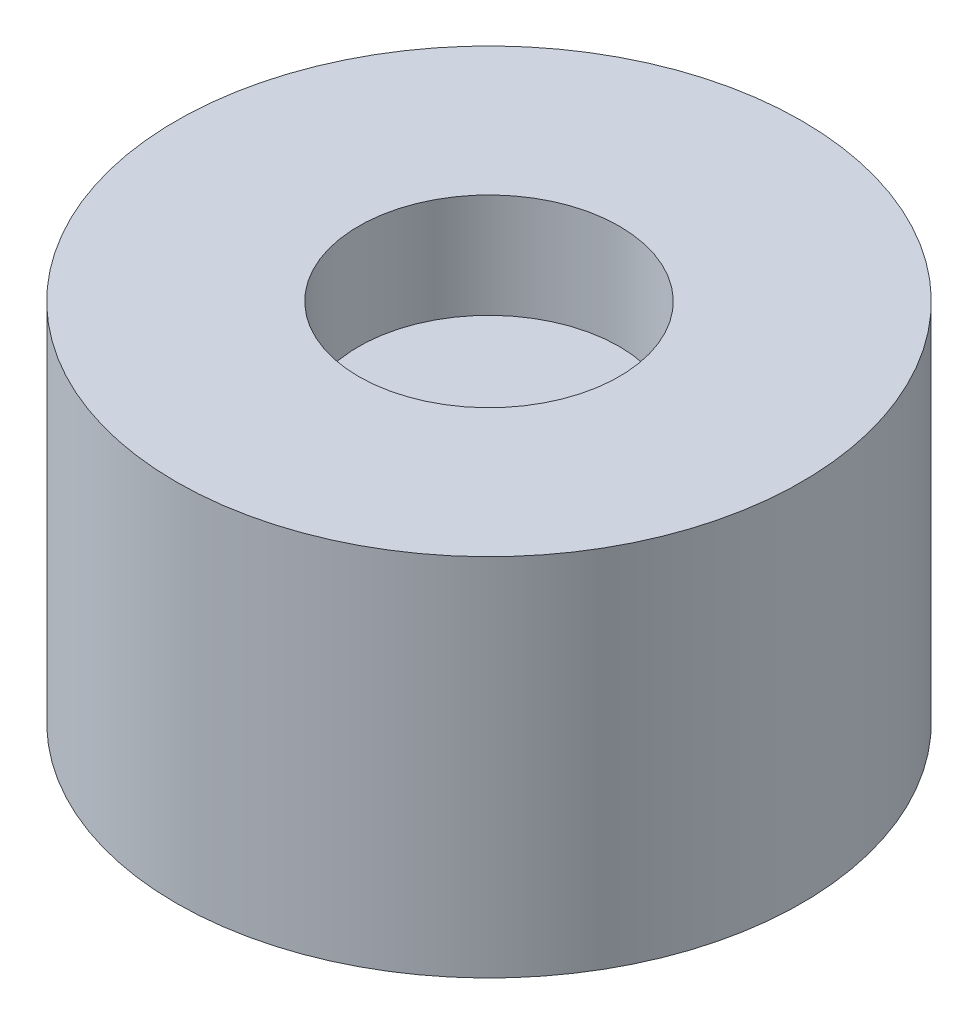
ISO-10303-21;
HEADER;
FILE_DESCRIPTION(('STEP AP214'),'2;1');
FILE_NAME('part.step','',(''),(''),'','','');
FILE_SCHEMA(('AUTOMOTIVE_DESIGN { 1 0 10303 214 1 1 1 1 }'));
ENDSEC;
DATA;
#1=APPLICATION_CONTEXT('core data for automotive mechanical design processes');
#2=APPLICATION_PROTOCOL_DEFINITION('international standard','automotive_design',2000,#1);
#3=PRODUCT_CONTEXT('',#1,'mechanical');
#4=PRODUCT('Part','Part','',(#3));
#5=PRODUCT_RELATED_PRODUCT_CATEGORY('part','',(#4));
#6=PRODUCT_DEFINITION_FORMATION('','',#4);
#7=PRODUCT_DEFINITION_CONTEXT('part definition',#1,'design');
#8=PRODUCT_DEFINITION('design','',#6,#7);
#9=PRODUCT_DEFINITION_SHAPE('','',#8);
#10=(LENGTH_UNIT() NAMED_UNIT(*) SI_UNIT(.MILLI.,.METRE.));
#11=(NAMED_UNIT(*) PLANE_ANGLE_UNIT() SI_UNIT($,.RADIAN.));
#12=(NAMED_UNIT(*) SI_UNIT($,.STERADIAN.) SOLID_ANGLE_UNIT());
#13=UNCERTAINTY_MEASURE_WITH_UNIT(LENGTH_MEASURE(1.E-05),#10,'distance_accuracy_value','');
#14=(GEOMETRIC_REPRESENTATION_CONTEXT(3) GLOBAL_UNCERTAINTY_ASSIGNED_CONTEXT((#13)) GLOBAL_UNIT_ASSIGNED_CONTEXT((#10,
#11,#12)) REPRESENTATION_CONTEXT('',''));
#15=CARTESIAN_POINT('',(0.,0.,0.));
#16=DIRECTION('',(0.,0.,1.));
#17=DIRECTION('',(1.,0.,0.));
#18=AXIS2_PLACEMENT_3D('',#15,#16,#17);
#19=CARTESIAN_POINT('',(0.,7.,0.));
#20=DIRECTION('',(0.,-1.,0.));
#21=DIRECTION('',(0.,0.,-1.));
#22=AXIS2_PLACEMENT_3D('',#19,#20,#21);
#23=CYLINDRICAL_SURFACE('',#22,6.);
#24=CARTESIAN_POINT('',(0.,7.,0.));
#25=DIRECTION('',(0.,1.,0.));
#26=DIRECTION('',(0.,0.,1.));
#27=AXIS2_PLACEMENT_3D('',#24,#25,#26);
#28=CIRCLE('',#27,6.);
#29=CARTESIAN_POINT('',(0.,7.,6.));
#30=VERTEX_POINT('',#29);
#31=EDGE_CURVE('E38',#30,#30,#28,.T.);
#32=ORIENTED_EDGE('',*,*,#31,.F.);
#33=EDGE_LOOP('',(#32));
#34=FACE_BOUND('',#33,.T.);
#35=CARTESIAN_POINT('',(0.,0.,0.));
#36=DIRECTION('',(0.,1.,0.));
#37=DIRECTION('',(0.,0.,1.));
#38=AXIS2_PLACEMENT_3D('',#35,#36,#37);
#39=CIRCLE('',#38,6.);
#40=CARTESIAN_POINT('',(0.,0.,6.));
#41=VERTEX_POINT('',#40);
#42=EDGE_CURVE('E42',#41,#41,#39,.T.);
#43=ORIENTED_EDGE('',*,*,#42,.T.);
#44=EDGE_LOOP('',(#43));
#45=FACE_BOUND('',#44,.T.);
#46=ADVANCED_FACE('F31',(#34,#45),#23,.T.);
#47=CARTESIAN_POINT('',(0.,7.,0.));
#48=DIRECTION('',(0.,1.,0.));
#49=DIRECTION('',(0.,0.,1.));
#50=AXIS2_PLACEMENT_3D('',#47,#48,#49);
#51=PLANE('',#50);
#52=CARTESIAN_POINT('',(0.,7.,0.));
#53=DIRECTION('',(0.,1.,0.));
#54=DIRECTION('',(0.,0.,1.));
#55=AXIS2_PLACEMENT_3D('',#52,#53,#54);
#56=CIRCLE('',#55,2.5);
#57=CARTESIAN_POINT('',(0.,7.,2.5));
#58=VERTEX_POINT('',#57);
#59=EDGE_CURVE('E49',#58,#58,#56,.T.);
#60=ORIENTED_EDGE('',*,*,#59,.F.);
#61=EDGE_LOOP('',(#60));
#62=FACE_BOUND('',#61,.T.);
#63=ORIENTED_EDGE('',*,*,#31,.T.);
#64=EDGE_LOOP('',(#63));
#65=FACE_BOUND('',#64,.T.);
#66=ADVANCED_FACE('F64',(#62,#65),#51,.T.);
#67=CARTESIAN_POINT('',(0.,0.,0.));
#68=DIRECTION('',(0.,1.,0.));
#69=DIRECTION('',(0.,0.,1.));
#70=AXIS2_PLACEMENT_3D('',#67,#68,#69);
#71=PLANE('',#70);
#72=CARTESIAN_POINT('',(0.,0.,0.));
#73=DIRECTION('',(0.,-1.,0.));
#74=DIRECTION('',(0.,0.,-1.));
#75=AXIS2_PLACEMENT_3D('',#72,#73,#74);
#76=CIRCLE('',#75,1.);
#77=CARTESIAN_POINT('',(0.,0.,-1.));
#78=VERTEX_POINT('',#77);
#79=EDGE_CURVE('E52',#78,#78,#76,.T.);
#80=ORIENTED_EDGE('',*,*,#79,.F.);
#81=EDGE_LOOP('',(#80));
#82=FACE_BOUND('',#81,.T.);
#83=ORIENTED_EDGE('',*,*,#42,.F.);
#84=EDGE_LOOP('',(#83));
#85=FACE_BOUND('',#84,.T.);
#86=ADVANCED_FACE('F60',(#82,#85),#71,.F.);
#87=CARTESIAN_POINT('',(0.,5.,0.));
#88=DIRECTION('',(0.,1.,0.));
#89=DIRECTION('',(0.,0.,1.));
#90=AXIS2_PLACEMENT_3D('',#87,#88,#89);
#91=CYLINDRICAL_SURFACE('',#90,2.5);
#92=CARTESIAN_POINT('',(0.,5.,0.));
#93=DIRECTION('',(0.,1.,0.));
#94=DIRECTION('',(0.,0.,1.));
#95=AXIS2_PLACEMENT_3D('',#92,#93,#94);
#96=CIRCLE('',#95,2.5);
#97=CARTESIAN_POINT('',(0.,5.,2.5));
#98=VERTEX_POINT('',#97);
#99=EDGE_CURVE('E47',#98,#98,#96,.T.);
#100=ORIENTED_EDGE('',*,*,#99,.F.);
#101=EDGE_LOOP('',(#100));
#102=FACE_BOUND('',#101,.T.);
#103=ORIENTED_EDGE('',*,*,#59,.T.);
#104=EDGE_LOOP('',(#103));
#105=FACE_BOUND('',#104,.T.);
#106=ADVANCED_FACE('F63',(#102,#105),#91,.F.);
#107=CARTESIAN_POINT('',(0.,5.,0.));
#108=DIRECTION('',(0.,1.,0.));
#109=DIRECTION('',(0.,0.,1.));
#110=AXIS2_PLACEMENT_3D('',#107,#108,#109);
#111=PLANE('',#110);
#112=ORIENTED_EDGE('',*,*,#99,.T.);
#113=EDGE_LOOP('',(#112));
#114=FACE_BOUND('',#113,.T.);
#115=ADVANCED_FACE('F78',(#114),#111,.T.);
#116=CARTESIAN_POINT('',(0.,2.,0.));
#117=DIRECTION('',(0.,-1.,0.));
#118=DIRECTION('',(0.,0.,-1.));
#119=AXIS2_PLACEMENT_3D('',#116,#117,#118);
#120=CYLINDRICAL_SURFACE('',#119,1.);
#121=CARTESIAN_POINT('',(0.,1.,0.));
#122=DIRECTION('',(0.,-1.,0.));
#123=DIRECTION('',(0.,0.,-1.));
#124=AXIS2_PLACEMENT_3D('',#121,#122,#123);
#125=CIRCLE('',#124,1.);
#126=CARTESIAN_POINT('',(0.,1.,-1.));
#127=VERTEX_POINT('',#126);
#128=EDGE_CURVE('E10',#127,#127,#125,.F.);
#129=ORIENTED_EDGE('',*,*,#128,.T.);
#130=EDGE_LOOP('',(#129));
#131=FACE_BOUND('',#130,.T.);
#132=ORIENTED_EDGE('',*,*,#79,.T.);
#133=EDGE_LOOP('',(#132));
#134=FACE_BOUND('',#133,.T.);
#135=ADVANCED_FACE('F58',(#131,#134),#120,.F.);
#136=CARTESIAN_POINT('',(0.,1.,0.));
#137=DIRECTION('',(0.,-1.,0.));
#138=DIRECTION('',(0.,0.,-1.));
#139=AXIS2_PLACEMENT_3D('',#136,#137,#138);
#140=SPHERICAL_SURFACE('',#139,1.);
#141=ORIENTED_EDGE('',*,*,#128,.F.);
#142=EDGE_LOOP('',(#141));
#143=FACE_BOUND('',#142,.T.);
#144=ADVANCED_FACE('F33',(#143),#140,.F.);
#145=CLOSED_SHELL('',(#46,#66,#86,#106,#115,#135,#144));
#146=MANIFOLD_SOLID_BREP('B2',#145);
#147=ADVANCED_BREP_SHAPE_REPRESENTATION('',(#18,#146),#14);
#148=SHAPE_DEFINITION_REPRESENTATION(#9,#147);
ENDSEC;
END-ISO-10303-21;
